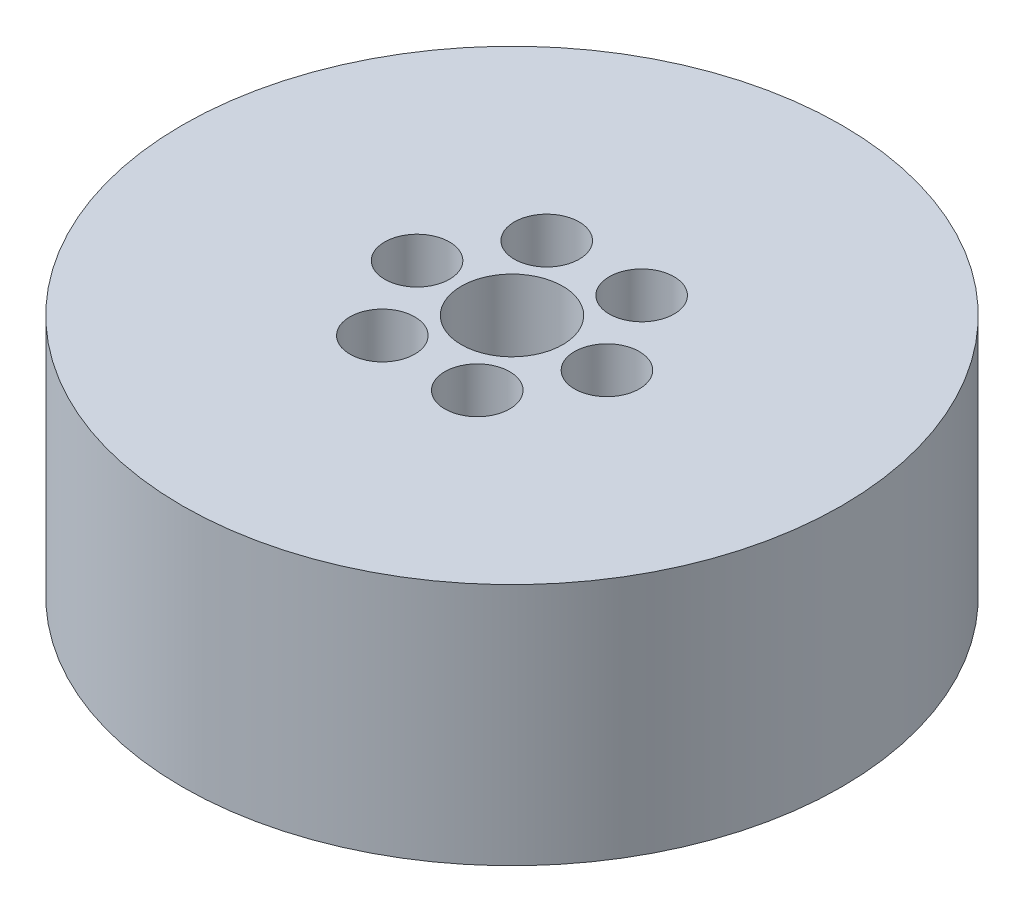
ISO-10303-21;
HEADER;
FILE_DESCRIPTION(('STEP AP214'),'2;1');
FILE_NAME('part.step','',(''),(''),'','','');
FILE_SCHEMA(('AUTOMOTIVE_DESIGN { 1 0 10303 214 1 1 1 1 }'));
ENDSEC;
DATA;
#1=APPLICATION_CONTEXT('core data for automotive mechanical design processes');
#2=APPLICATION_PROTOCOL_DEFINITION('international standard','automotive_design',2000,#1);
#3=PRODUCT_CONTEXT('',#1,'mechanical');
#4=PRODUCT('Part','Part','',(#3));
#5=PRODUCT_RELATED_PRODUCT_CATEGORY('part','',(#4));
#6=PRODUCT_DEFINITION_FORMATION('','',#4);
#7=PRODUCT_DEFINITION_CONTEXT('part definition',#1,'design');
#8=PRODUCT_DEFINITION('design','',#6,#7);
#9=PRODUCT_DEFINITION_SHAPE('','',#8);
#10=(LENGTH_UNIT() NAMED_UNIT(*) SI_UNIT(.MILLI.,.METRE.));
#11=(NAMED_UNIT(*) PLANE_ANGLE_UNIT() SI_UNIT($,.RADIAN.));
#12=(NAMED_UNIT(*) SI_UNIT($,.STERADIAN.) SOLID_ANGLE_UNIT());
#13=UNCERTAINTY_MEASURE_WITH_UNIT(LENGTH_MEASURE(1.E-05),#10,'distance_accuracy_value','');
#14=(GEOMETRIC_REPRESENTATION_CONTEXT(3) GLOBAL_UNCERTAINTY_ASSIGNED_CONTEXT((#13)) GLOBAL_UNIT_ASSIGNED_CONTEXT((#10,
#11,#12)) REPRESENTATION_CONTEXT('',''));
#15=CARTESIAN_POINT('',(0.,0.,0.));
#16=DIRECTION('',(0.,0.,1.));
#17=DIRECTION('',(1.,0.,0.));
#18=AXIS2_PLACEMENT_3D('',#15,#16,#17);
#19=CARTESIAN_POINT('',(0.,24.,0.));
#20=DIRECTION('',(0.,-1.,0.));
#21=DIRECTION('',(0.,0.,-1.));
#22=AXIS2_PLACEMENT_3D('',#19,#20,#21);
#23=CYLINDRICAL_SURFACE('',#22,32.5);
#24=CARTESIAN_POINT('',(0.,24.,0.));
#25=DIRECTION('',(0.,1.,0.));
#26=DIRECTION('',(0.,0.,1.));
#27=AXIS2_PLACEMENT_3D('',#24,#25,#26);
#28=CIRCLE('',#27,32.5);
#29=CARTESIAN_POINT('',(0.,24.,32.5));
#30=VERTEX_POINT('',#29);
#31=EDGE_CURVE('E10',#30,#30,#28,.T.);
#32=ORIENTED_EDGE('',*,*,#31,.F.);
#33=EDGE_LOOP('',(#32));
#34=FACE_BOUND('',#33,.T.);
#35=CARTESIAN_POINT('',(0.,0.,0.));
#36=DIRECTION('',(0.,1.,0.));
#37=DIRECTION('',(0.,0.,1.));
#38=AXIS2_PLACEMENT_3D('',#35,#36,#37);
#39=CIRCLE('',#38,32.5);
#40=CARTESIAN_POINT('',(0.,0.,32.5));
#41=VERTEX_POINT('',#40);
#42=EDGE_CURVE('E37',#41,#41,#39,.T.);
#43=ORIENTED_EDGE('',*,*,#42,.T.);
#44=EDGE_LOOP('',(#43));
#45=FACE_BOUND('',#44,.T.);
#46=ADVANCED_FACE('F40',(#34,#45),#23,.T.);
#47=CARTESIAN_POINT('',(0.,24.,0.));
#48=DIRECTION('',(0.,1.,0.));
#49=DIRECTION('',(0.,0.,1.));
#50=AXIS2_PLACEMENT_3D('',#47,#48,#49);
#51=PLANE('',#50);
#52=CARTESIAN_POINT('',(-4.67848075868428,24.,-8.10336637627435));
#53=DIRECTION('',(0.,1.,0.));
#54=DIRECTION('',(-0.866025403784433,0.,0.50000000000001));
#55=AXIS2_PLACEMENT_3D('',#52,#53,#54);
#56=CIRCLE('',#55,3.19395747275403);
#57=CARTESIAN_POINT('',(-7.4445290686964,24.,-6.5063876398973));
#58=VERTEX_POINT('',#57);
#59=EDGE_CURVE('E70',#58,#58,#56,.T.);
#60=ORIENTED_EDGE('',*,*,#59,.F.);
#61=EDGE_LOOP('',(#60));
#62=FACE_BOUND('',#61,.T.);
#63=CARTESIAN_POINT('',(4.67848075868411,24.,-8.10336637627445));
#64=DIRECTION('',(0.,1.,0.));
#65=DIRECTION('',(-0.866025403784443,0.,-0.499999999999992));
#66=AXIS2_PLACEMENT_3D('',#63,#64,#65);
#67=CIRCLE('',#66,3.19395747275403);
#68=CARTESIAN_POINT('',(1.91243244867197,24.,-9.70034511265144));
#69=VERTEX_POINT('',#68);
#70=EDGE_CURVE('E71',#69,#69,#67,.T.);
#71=ORIENTED_EDGE('',*,*,#70,.F.);
#72=EDGE_LOOP('',(#71));
#73=FACE_BOUND('',#72,.T.);
#74=CARTESIAN_POINT('',(9.35696151736838,24.,0.));
#75=DIRECTION('',(0.,1.,0.));
#76=DIRECTION('',(0.,0.,-1.));
#77=AXIS2_PLACEMENT_3D('',#74,#75,#76);
#78=CIRCLE('',#77,3.19395747275403);
#79=CARTESIAN_POINT('',(9.35696151736838,24.,-3.19395747275403));
#80=VERTEX_POINT('',#79);
#81=EDGE_CURVE('E78',#80,#80,#78,.T.);
#82=ORIENTED_EDGE('',*,*,#81,.F.);
#83=EDGE_LOOP('',(#82));
#84=FACE_BOUND('',#83,.T.);
#85=CARTESIAN_POINT('',(4.67848075868423,24.,8.10336637627438));
#86=DIRECTION('',(0.,1.,0.));
#87=DIRECTION('',(0.866025403784436,0.,-0.500000000000004));
#88=AXIS2_PLACEMENT_3D('',#85,#86,#87);
#89=CIRCLE('',#88,3.19395747275403);
#90=CARTESIAN_POINT('',(7.44452906869635,24.,6.50638763989736));
#91=VERTEX_POINT('',#90);
#92=EDGE_CURVE('E84',#91,#91,#89,.T.);
#93=ORIENTED_EDGE('',*,*,#92,.F.);
#94=EDGE_LOOP('',(#93));
#95=FACE_BOUND('',#94,.T.);
#96=CARTESIAN_POINT('',(-4.67848075868417,24.,8.10336637627442));
#97=DIRECTION('',(0.,1.,0.));
#98=DIRECTION('',(0.86602540378444,0.,0.499999999999998));
#99=AXIS2_PLACEMENT_3D('',#96,#97,#98);
#100=CIRCLE('',#99,3.19395747275403);
#101=CARTESIAN_POINT('',(-1.91243244867203,24.,9.70034511265142));
#102=VERTEX_POINT('',#101);
#103=EDGE_CURVE('E61',#102,#102,#100,.T.);
#104=ORIENTED_EDGE('',*,*,#103,.F.);
#105=EDGE_LOOP('',(#104));
#106=FACE_BOUND('',#105,.T.);
#107=CARTESIAN_POINT('',(-9.35696151736838,24.,0.));
#108=DIRECTION('',(0.,1.,0.));
#109=DIRECTION('',(0.,0.,1.));
#110=AXIS2_PLACEMENT_3D('',#107,#108,#109);
#111=CIRCLE('',#110,3.19395747275403);
#112=CARTESIAN_POINT('',(-9.35696151736838,24.,3.19395747275403));
#113=VERTEX_POINT('',#112);
#114=EDGE_CURVE('E54',#113,#113,#111,.T.);
#115=ORIENTED_EDGE('',*,*,#114,.F.);
#116=EDGE_LOOP('',(#115));
#117=FACE_BOUND('',#116,.T.);
#118=CARTESIAN_POINT('',(0.,24.,0.));
#119=DIRECTION('',(0.,1.,0.));
#120=DIRECTION('',(0.,0.,1.));
#121=AXIS2_PLACEMENT_3D('',#118,#119,#120);
#122=CIRCLE('',#121,5.);
#123=CARTESIAN_POINT('',(0.,24.,5.));
#124=VERTEX_POINT('',#123);
#125=EDGE_CURVE('E50',#124,#124,#122,.T.);
#126=ORIENTED_EDGE('',*,*,#125,.F.);
#127=EDGE_LOOP('',(#126));
#128=FACE_BOUND('',#127,.T.);
#129=ORIENTED_EDGE('',*,*,#31,.T.);
#130=EDGE_LOOP('',(#129));
#131=FACE_BOUND('',#130,.T.);
#132=ADVANCED_FACE('F99',(#62,#73,#84,#95,#106,#117,#128,#131),#51,.T.);
#133=CARTESIAN_POINT('',(0.,0.,0.));
#134=DIRECTION('',(0.,1.,0.));
#135=DIRECTION('',(0.,0.,1.));
#136=AXIS2_PLACEMENT_3D('',#133,#134,#135);
#137=PLANE('',#136);
#138=CARTESIAN_POINT('',(0.,0.,0.));
#139=DIRECTION('',(0.,1.,0.));
#140=DIRECTION('',(0.,0.,1.));
#141=AXIS2_PLACEMENT_3D('',#138,#139,#140);
#142=CIRCLE('',#141,5.);
#143=CARTESIAN_POINT('',(0.,0.,5.));
#144=VERTEX_POINT('',#143);
#145=EDGE_CURVE('E47',#144,#144,#142,.T.);
#146=ORIENTED_EDGE('',*,*,#145,.T.);
#147=EDGE_LOOP('',(#146));
#148=FACE_BOUND('',#147,.T.);
#149=ORIENTED_EDGE('',*,*,#42,.F.);
#150=EDGE_LOOP('',(#149));
#151=FACE_BOUND('',#150,.T.);
#152=ADVANCED_FACE('F103',(#148,#151),#137,.F.);
#153=CARTESIAN_POINT('',(0.,24.,0.));
#154=DIRECTION('',(0.,-1.,0.));
#155=DIRECTION('',(0.,0.,-1.));
#156=AXIS2_PLACEMENT_3D('',#153,#154,#155);
#157=CYLINDRICAL_SURFACE('',#156,5.);
#158=ORIENTED_EDGE('',*,*,#125,.T.);
#159=EDGE_LOOP('',(#158));
#160=FACE_BOUND('',#159,.T.);
#161=ORIENTED_EDGE('',*,*,#145,.F.);
#162=EDGE_LOOP('',(#161));
#163=FACE_BOUND('',#162,.T.);
#164=ADVANCED_FACE('F115',(#160,#163),#157,.F.);
#165=CARTESIAN_POINT('',(-9.35696151736838,5.17624990433137,0.));
#166=DIRECTION('',(0.,1.,0.));
#167=DIRECTION('',(0.,0.,1.));
#168=AXIS2_PLACEMENT_3D('',#165,#166,#167);
#169=CYLINDRICAL_SURFACE('',#168,3.19395747275403);
#170=CARTESIAN_POINT('',(-9.35696151736838,5.17624990433137,0.));
#171=DIRECTION('',(0.,1.,0.));
#172=DIRECTION('',(0.,0.,1.));
#173=AXIS2_PLACEMENT_3D('',#170,#171,#172);
#174=CIRCLE('',#173,3.19395747275403);
#175=CARTESIAN_POINT('',(-9.35696151736838,5.17624990433137,3.19395747275403));
#176=VERTEX_POINT('',#175);
#177=EDGE_CURVE('E55',#176,#176,#174,.T.);
#178=ORIENTED_EDGE('',*,*,#177,.F.);
#179=EDGE_LOOP('',(#178));
#180=FACE_BOUND('',#179,.T.);
#181=ORIENTED_EDGE('',*,*,#114,.T.);
#182=EDGE_LOOP('',(#181));
#183=FACE_BOUND('',#182,.T.);
#184=ADVANCED_FACE('F113',(#180,#183),#169,.F.);
#185=CARTESIAN_POINT('',(-9.35696151736838,5.17624990433137,0.));
#186=DIRECTION('',(0.,1.,0.));
#187=DIRECTION('',(0.,0.,1.));
#188=AXIS2_PLACEMENT_3D('',#185,#186,#187);
#189=PLANE('',#188);
#190=ORIENTED_EDGE('',*,*,#177,.T.);
#191=EDGE_LOOP('',(#190));
#192=FACE_BOUND('',#191,.T.);
#193=ADVANCED_FACE('F144',(#192),#189,.T.);
#194=CARTESIAN_POINT('',(-4.67848075868417,5.17624990433137,8.10336637627442));
#195=DIRECTION('',(0.,1.,0.));
#196=DIRECTION('',(0.,0.,1.));
#197=AXIS2_PLACEMENT_3D('',#194,#195,#196);
#198=CYLINDRICAL_SURFACE('',#197,3.19395747275403);
#199=CARTESIAN_POINT('',(-4.67848075868417,5.17624990433137,8.10336637627442));
#200=DIRECTION('',(0.,1.,0.));
#201=DIRECTION('',(0.86602540378444,0.,0.499999999999998));
#202=AXIS2_PLACEMENT_3D('',#199,#200,#201);
#203=CIRCLE('',#202,3.19395747275403);
#204=CARTESIAN_POINT('',(-1.91243244867203,5.17624990433137,9.70034511265142));
#205=VERTEX_POINT('',#204);
#206=EDGE_CURVE('E59',#205,#205,#203,.T.);
#207=ORIENTED_EDGE('',*,*,#206,.F.);
#208=EDGE_LOOP('',(#207));
#209=FACE_BOUND('',#208,.T.);
#210=ORIENTED_EDGE('',*,*,#103,.T.);
#211=EDGE_LOOP('',(#210));
#212=FACE_BOUND('',#211,.T.);
#213=ADVANCED_FACE('F153',(#209,#212),#198,.F.);
#214=CARTESIAN_POINT('',(-4.67848075868417,5.17624990433137,8.10336637627442));
#215=DIRECTION('',(0.,1.,0.));
#216=DIRECTION('',(0.86602540378444,0.,0.499999999999998));
#217=AXIS2_PLACEMENT_3D('',#214,#215,#216);
#218=PLANE('',#217);
#219=ORIENTED_EDGE('',*,*,#206,.T.);
#220=EDGE_LOOP('',(#219));
#221=FACE_BOUND('',#220,.T.);
#222=ADVANCED_FACE('F96',(#221),#218,.T.);
#223=CARTESIAN_POINT('',(4.67848075868423,5.17624990433137,8.10336637627438));
#224=DIRECTION('',(0.,1.,0.));
#225=DIRECTION('',(0.,0.,1.));
#226=AXIS2_PLACEMENT_3D('',#223,#224,#225);
#227=CYLINDRICAL_SURFACE('',#226,3.19395747275403);
#228=CARTESIAN_POINT('',(4.67848075868423,5.17624990433137,8.10336637627438));
#229=DIRECTION('',(0.,1.,0.));
#230=DIRECTION('',(0.866025403784436,0.,-0.500000000000004));
#231=AXIS2_PLACEMENT_3D('',#228,#229,#230);
#232=CIRCLE('',#231,3.19395747275403);
#233=CARTESIAN_POINT('',(7.44452906869635,5.17624990433137,6.50638763989736));
#234=VERTEX_POINT('',#233);
#235=EDGE_CURVE('E63',#234,#234,#232,.T.);
#236=ORIENTED_EDGE('',*,*,#235,.F.);
#237=EDGE_LOOP('',(#236));
#238=FACE_BOUND('',#237,.T.);
#239=ORIENTED_EDGE('',*,*,#92,.T.);
#240=EDGE_LOOP('',(#239));
#241=FACE_BOUND('',#240,.T.);
#242=ADVANCED_FACE('F91',(#238,#241),#227,.F.);
#243=CARTESIAN_POINT('',(4.67848075868423,5.17624990433137,8.10336637627438));
#244=DIRECTION('',(0.,1.,0.));
#245=DIRECTION('',(0.866025403784436,0.,-0.500000000000004));
#246=AXIS2_PLACEMENT_3D('',#243,#244,#245);
#247=PLANE('',#246);
#248=ORIENTED_EDGE('',*,*,#235,.T.);
#249=EDGE_LOOP('',(#248));
#250=FACE_BOUND('',#249,.T.);
#251=ADVANCED_FACE('F93',(#250),#247,.T.);
#252=CARTESIAN_POINT('',(9.35696151736838,5.17624990433137,0.));
#253=DIRECTION('',(0.,1.,0.));
#254=DIRECTION('',(0.,0.,1.));
#255=AXIS2_PLACEMENT_3D('',#252,#253,#254);
#256=CYLINDRICAL_SURFACE('',#255,3.19395747275403);
#257=CARTESIAN_POINT('',(9.35696151736838,5.17624990433137,0.));
#258=DIRECTION('',(0.,1.,0.));
#259=DIRECTION('',(0.,0.,-1.));
#260=AXIS2_PLACEMENT_3D('',#257,#258,#259);
#261=CIRCLE('',#260,3.19395747275403);
#262=CARTESIAN_POINT('',(9.35696151736838,5.17624990433137,-3.19395747275403));
#263=VERTEX_POINT('',#262);
#264=EDGE_CURVE('E85',#263,#263,#261,.T.);
#265=ORIENTED_EDGE('',*,*,#264,.F.);
#266=EDGE_LOOP('',(#265));
#267=FACE_BOUND('',#266,.T.);
#268=ORIENTED_EDGE('',*,*,#81,.T.);
#269=EDGE_LOOP('',(#268));
#270=FACE_BOUND('',#269,.T.);
#271=ADVANCED_FACE('F187',(#267,#270),#256,.F.);
#272=CARTESIAN_POINT('',(9.35696151736838,5.17624990433137,0.));
#273=DIRECTION('',(0.,1.,0.));
#274=DIRECTION('',(0.,0.,-1.));
#275=AXIS2_PLACEMENT_3D('',#272,#273,#274);
#276=PLANE('',#275);
#277=ORIENTED_EDGE('',*,*,#264,.T.);
#278=EDGE_LOOP('',(#277));
#279=FACE_BOUND('',#278,.T.);
#280=ADVANCED_FACE('F198',(#279),#276,.T.);
#281=CARTESIAN_POINT('',(4.67848075868411,5.17624990433137,-8.10336637627445));
#282=DIRECTION('',(0.,1.,0.));
#283=DIRECTION('',(0.,0.,1.));
#284=AXIS2_PLACEMENT_3D('',#281,#282,#283);
#285=CYLINDRICAL_SURFACE('',#284,3.19395747275403);
#286=CARTESIAN_POINT('',(4.67848075868411,5.17624990433137,-8.10336637627445));
#287=DIRECTION('',(0.,1.,0.));
#288=DIRECTION('',(-0.866025403784443,0.,-0.499999999999992));
#289=AXIS2_PLACEMENT_3D('',#286,#287,#288);
#290=CIRCLE('',#289,3.19395747275403);
#291=CARTESIAN_POINT('',(1.91243244867197,5.17624990433137,-9.70034511265144));
#292=VERTEX_POINT('',#291);
#293=EDGE_CURVE('E76',#292,#292,#290,.T.);
#294=ORIENTED_EDGE('',*,*,#293,.F.);
#295=EDGE_LOOP('',(#294));
#296=FACE_BOUND('',#295,.T.);
#297=ORIENTED_EDGE('',*,*,#70,.T.);
#298=EDGE_LOOP('',(#297));
#299=FACE_BOUND('',#298,.T.);
#300=ADVANCED_FACE('F202',(#296,#299),#285,.F.);
#301=CARTESIAN_POINT('',(4.67848075868411,5.17624990433137,-8.10336637627445));
#302=DIRECTION('',(0.,1.,0.));
#303=DIRECTION('',(-0.866025403784443,0.,-0.499999999999992));
#304=AXIS2_PLACEMENT_3D('',#301,#302,#303);
#305=PLANE('',#304);
#306=ORIENTED_EDGE('',*,*,#293,.T.);
#307=EDGE_LOOP('',(#306));
#308=FACE_BOUND('',#307,.T.);
#309=ADVANCED_FACE('F212',(#308),#305,.T.);
#310=CARTESIAN_POINT('',(-4.67848075868428,5.17624990433137,-8.10336637627435));
#311=DIRECTION('',(0.,1.,0.));
#312=DIRECTION('',(0.,0.,1.));
#313=AXIS2_PLACEMENT_3D('',#310,#311,#312);
#314=CYLINDRICAL_SURFACE('',#313,3.19395747275403);
#315=CARTESIAN_POINT('',(-4.67848075868428,5.17624990433137,-8.10336637627435));
#316=DIRECTION('',(0.,1.,0.));
#317=DIRECTION('',(-0.866025403784433,0.,0.50000000000001));
#318=AXIS2_PLACEMENT_3D('',#315,#316,#317);
#319=CIRCLE('',#318,3.19395747275403);
#320=CARTESIAN_POINT('',(-7.4445290686964,5.17624990433137,-6.5063876398973));
#321=VERTEX_POINT('',#320);
#322=EDGE_CURVE('E69',#321,#321,#319,.T.);
#323=ORIENTED_EDGE('',*,*,#322,.F.);
#324=EDGE_LOOP('',(#323));
#325=FACE_BOUND('',#324,.T.);
#326=ORIENTED_EDGE('',*,*,#59,.T.);
#327=EDGE_LOOP('',(#326));
#328=FACE_BOUND('',#327,.T.);
#329=ADVANCED_FACE('F224',(#325,#328),#314,.F.);
#330=CARTESIAN_POINT('',(-4.67848075868428,5.17624990433137,-8.10336637627435));
#331=DIRECTION('',(0.,1.,0.));
#332=DIRECTION('',(-0.866025403784433,0.,0.50000000000001));
#333=AXIS2_PLACEMENT_3D('',#330,#331,#332);
#334=PLANE('',#333);
#335=ORIENTED_EDGE('',*,*,#322,.T.);
#336=EDGE_LOOP('',(#335));
#337=FACE_BOUND('',#336,.T.);
#338=ADVANCED_FACE('F235',(#337),#334,.T.);
#339=CLOSED_SHELL('',(#46,#132,#152,#164,#184,#193,#213,#222,#242,#251,#271,#280,#300,#309,#329,#338));
#340=MANIFOLD_SOLID_BREP('B2',#339);
#341=ADVANCED_BREP_SHAPE_REPRESENTATION('',(#18,#340),#14);
#342=SHAPE_DEFINITION_REPRESENTATION(#9,#341);
ENDSEC;
END-ISO-10303-21;
